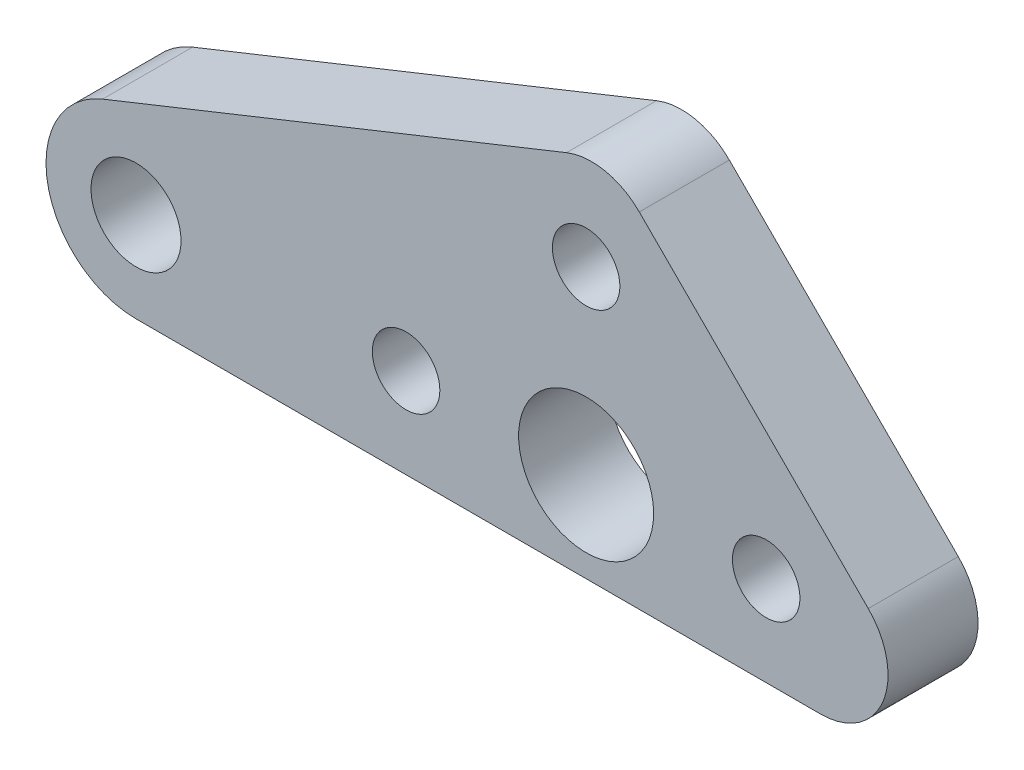
ISO-10303-21;
HEADER;
FILE_DESCRIPTION(('STEP AP214'),'2;1');
FILE_NAME('part.step','',(''),(''),'','','');
FILE_SCHEMA(('AUTOMOTIVE_DESIGN { 1 0 10303 214 1 1 1 1 }'));
ENDSEC;
DATA;
#1=APPLICATION_CONTEXT('core data for automotive mechanical design processes');
#2=APPLICATION_PROTOCOL_DEFINITION('international standard','automotive_design',2000,#1);
#3=PRODUCT_CONTEXT('',#1,'mechanical');
#4=PRODUCT('Part','Part','',(#3));
#5=PRODUCT_RELATED_PRODUCT_CATEGORY('part','',(#4));
#6=PRODUCT_DEFINITION_FORMATION('','',#4);
#7=PRODUCT_DEFINITION_CONTEXT('part definition',#1,'design');
#8=PRODUCT_DEFINITION('design','',#6,#7);
#9=PRODUCT_DEFINITION_SHAPE('','',#8);
#10=(LENGTH_UNIT() NAMED_UNIT(*) SI_UNIT(.MILLI.,.METRE.));
#11=(NAMED_UNIT(*) PLANE_ANGLE_UNIT() SI_UNIT($,.RADIAN.));
#12=(NAMED_UNIT(*) SI_UNIT($,.STERADIAN.) SOLID_ANGLE_UNIT());
#13=UNCERTAINTY_MEASURE_WITH_UNIT(LENGTH_MEASURE(1.E-05),#10,'distance_accuracy_value','');
#14=(GEOMETRIC_REPRESENTATION_CONTEXT(3) GLOBAL_UNCERTAINTY_ASSIGNED_CONTEXT((#13)) GLOBAL_UNIT_ASSIGNED_CONTEXT((#10,
#11,#12)) REPRESENTATION_CONTEXT('',''));
#15=CARTESIAN_POINT('',(0.,0.,0.));
#16=DIRECTION('',(0.,0.,1.));
#17=DIRECTION('',(1.,0.,0.));
#18=AXIS2_PLACEMENT_3D('',#15,#16,#17);
#19=CARTESIAN_POINT('',(10.4142135623731,-1.,4.));
#20=DIRECTION('',(0.,0.,1.));
#21=DIRECTION('',(1.,0.,0.));
#22=AXIS2_PLACEMENT_3D('',#19,#20,#21);
#23=PLANE('',#22);
#24=CARTESIAN_POINT('',(0.,0.,4.));
#25=DIRECTION('',(0.,0.,1.));
#26=DIRECTION('',(1.,0.,0.));
#27=AXIS2_PLACEMENT_3D('',#24,#25,#26);
#28=CIRCLE('',#27,3.);
#29=CARTESIAN_POINT('',(3.,0.,4.));
#30=VERTEX_POINT('',#29);
#31=EDGE_CURVE('E208',#30,#30,#28,.T.);
#32=ORIENTED_EDGE('',*,*,#31,.F.);
#33=EDGE_LOOP('',(#32));
#34=FACE_BOUND('',#33,.T.);
#35=CARTESIAN_POINT('',(8.,0.,4.));
#36=DIRECTION('',(0.,0.,1.));
#37=DIRECTION('',(1.,0.,0.));
#38=AXIS2_PLACEMENT_3D('',#35,#36,#37);
#39=CIRCLE('',#38,1.5);
#40=CARTESIAN_POINT('',(9.5,0.,4.));
#41=VERTEX_POINT('',#40);
#42=EDGE_CURVE('E147',#41,#41,#39,.T.);
#43=ORIENTED_EDGE('',*,*,#42,.F.);
#44=EDGE_LOOP('',(#43));
#45=FACE_BOUND('',#44,.T.);
#46=CARTESIAN_POINT('',(10.4142135623731,-1.,4.));
#47=DIRECTION('',(0.,0.,1.));
#48=DIRECTION('',(1.,0.,0.));
#49=AXIS2_PLACEMENT_3D('',#46,#47,#48);
#50=CIRCLE('',#49,3.);
#51=CARTESIAN_POINT('',(10.4142135623731,-4.,4.));
#52=VERTEX_POINT('',#51);
#53=CARTESIAN_POINT('',(12.5355339059327,1.12132034355964,4.));
#54=VERTEX_POINT('',#53);
#55=EDGE_CURVE('E148',#52,#54,#50,.T.);
#56=ORIENTED_EDGE('',*,*,#55,.T.);
#57=DIRECTION('',(-0.707106781186548,0.707106781186547,0.));
#58=VECTOR('',#57,1.);
#59=CARTESIAN_POINT('',(12.5355339059327,1.12132034355964,4.));
#60=LINE('',#59,#58);
#61=CARTESIAN_POINT('',(2.36216362994978,11.2946906195426,4.));
#62=VERTEX_POINT('',#61);
#63=EDGE_CURVE('E91',#54,#62,#60,.T.);
#64=ORIENTED_EDGE('',*,*,#63,.T.);
#65=CARTESIAN_POINT('',(0.240843286390138,9.17337027598296,4.));
#66=DIRECTION('',(0.,0.,1.));
#67=DIRECTION('',(-1.,0.,0.));
#68=AXIS2_PLACEMENT_3D('',#65,#66,#67);
#69=CIRCLE('',#68,3.);
#70=CARTESIAN_POINT('',(-0.873328742672173,11.9588003486387,4.));
#71=VERTEX_POINT('',#70);
#72=EDGE_CURVE('E104',#62,#71,#69,.T.);
#73=ORIENTED_EDGE('',*,*,#72,.T.);
#74=DIRECTION('',(-0.928476690885259,-0.371390676354104,0.));
#75=VECTOR('',#74,1.);
#76=CARTESIAN_POINT('',(-0.873328742672173,11.9588003486387,4.));
#77=LINE('',#76,#75);
#78=CARTESIAN_POINT('',(-21.4855627054164,3.71390676354104,4.));
#79=VERTEX_POINT('',#78);
#80=EDGE_CURVE('E98',#71,#79,#77,.T.);
#81=ORIENTED_EDGE('',*,*,#80,.T.);
#82=CARTESIAN_POINT('',(-20.,0.,4.));
#83=DIRECTION('',(0.,0.,1.));
#84=DIRECTION('',(1.,0.,0.));
#85=AXIS2_PLACEMENT_3D('',#82,#83,#84);
#86=CIRCLE('',#85,4.);
#87=CARTESIAN_POINT('',(-20.,-4.,4.));
#88=VERTEX_POINT('',#87);
#89=EDGE_CURVE('E102',#79,#88,#86,.T.);
#90=ORIENTED_EDGE('',*,*,#89,.T.);
#91=DIRECTION('',(1.,0.,0.));
#92=VECTOR('',#91,1.);
#93=CARTESIAN_POINT('',(-20.,-4.,4.));
#94=LINE('',#93,#92);
#95=EDGE_CURVE('E54',#88,#52,#94,.T.);
#96=ORIENTED_EDGE('',*,*,#95,.T.);
#97=EDGE_LOOP('',(#56,#64,#73,#81,#90,#96));
#98=FACE_BOUND('',#97,.T.);
#99=CARTESIAN_POINT('',(0.,8.,4.));
#100=DIRECTION('',(0.,0.,1.));
#101=DIRECTION('',(1.,0.,0.));
#102=AXIS2_PLACEMENT_3D('',#99,#100,#101);
#103=CIRCLE('',#102,1.5);
#104=CARTESIAN_POINT('',(1.5,8.,4.));
#105=VERTEX_POINT('',#104);
#106=EDGE_CURVE('E135',#105,#105,#103,.T.);
#107=ORIENTED_EDGE('',*,*,#106,.F.);
#108=EDGE_LOOP('',(#107));
#109=FACE_BOUND('',#108,.T.);
#110=CARTESIAN_POINT('',(-20.,0.,4.));
#111=DIRECTION('',(0.,0.,1.));
#112=DIRECTION('',(1.,0.,0.));
#113=AXIS2_PLACEMENT_3D('',#110,#111,#112);
#114=CIRCLE('',#113,2.);
#115=CARTESIAN_POINT('',(-18.,0.,4.));
#116=VERTEX_POINT('',#115);
#117=EDGE_CURVE('E213',#116,#116,#114,.T.);
#118=ORIENTED_EDGE('',*,*,#117,.F.);
#119=EDGE_LOOP('',(#118));
#120=FACE_BOUND('',#119,.T.);
#121=CARTESIAN_POINT('',(-8.,0.,4.));
#122=DIRECTION('',(0.,0.,1.));
#123=DIRECTION('',(1.,0.,0.));
#124=AXIS2_PLACEMENT_3D('',#121,#122,#123);
#125=CIRCLE('',#124,1.5);
#126=CARTESIAN_POINT('',(-6.5,0.,4.));
#127=VERTEX_POINT('',#126);
#128=EDGE_CURVE('E202',#127,#127,#125,.T.);
#129=ORIENTED_EDGE('',*,*,#128,.F.);
#130=EDGE_LOOP('',(#129));
#131=FACE_BOUND('',#130,.T.);
#132=ADVANCED_FACE('F37',(#34,#45,#98,#109,#120,#131),#23,.T.);
#133=CARTESIAN_POINT('',(10.4142135623731,-1.,0.));
#134=DIRECTION('',(0.,0.,1.));
#135=DIRECTION('',(1.,0.,0.));
#136=AXIS2_PLACEMENT_3D('',#133,#134,#135);
#137=PLANE('',#136);
#138=CARTESIAN_POINT('',(10.4142135623731,-1.,0.));
#139=DIRECTION('',(0.,0.,1.));
#140=DIRECTION('',(1.,0.,0.));
#141=AXIS2_PLACEMENT_3D('',#138,#139,#140);
#142=CIRCLE('',#141,3.);
#143=CARTESIAN_POINT('',(10.4142135623731,-4.,0.));
#144=VERTEX_POINT('',#143);
#145=CARTESIAN_POINT('',(12.5355339059327,1.12132034355964,0.));
#146=VERTEX_POINT('',#145);
#147=EDGE_CURVE('E141',#144,#146,#142,.T.);
#148=ORIENTED_EDGE('',*,*,#147,.F.);
#149=DIRECTION('',(1.,0.,0.));
#150=VECTOR('',#149,1.);
#151=CARTESIAN_POINT('',(-20.,-4.,0.));
#152=LINE('',#151,#150);
#153=CARTESIAN_POINT('',(-20.,-4.,0.));
#154=VERTEX_POINT('',#153);
#155=EDGE_CURVE('E83',#154,#144,#152,.T.);
#156=ORIENTED_EDGE('',*,*,#155,.F.);
#157=CARTESIAN_POINT('',(-20.,0.,0.));
#158=DIRECTION('',(0.,0.,1.));
#159=DIRECTION('',(1.,0.,0.));
#160=AXIS2_PLACEMENT_3D('',#157,#158,#159);
#161=CIRCLE('',#160,4.);
#162=CARTESIAN_POINT('',(-21.4855627054164,3.71390676354104,0.));
#163=VERTEX_POINT('',#162);
#164=EDGE_CURVE('E77',#163,#154,#161,.T.);
#165=ORIENTED_EDGE('',*,*,#164,.F.);
#166=DIRECTION('',(-0.928476690885259,-0.371390676354104,0.));
#167=VECTOR('',#166,1.);
#168=CARTESIAN_POINT('',(-0.873328742672173,11.9588003486387,0.));
#169=LINE('',#168,#167);
#170=CARTESIAN_POINT('',(-0.873328742672173,11.9588003486387,0.));
#171=VERTEX_POINT('',#170);
#172=EDGE_CURVE('E113',#171,#163,#169,.T.);
#173=ORIENTED_EDGE('',*,*,#172,.F.);
#174=CARTESIAN_POINT('',(0.240843286390138,9.17337027598296,0.));
#175=DIRECTION('',(0.,0.,1.));
#176=DIRECTION('',(-1.,0.,0.));
#177=AXIS2_PLACEMENT_3D('',#174,#175,#176);
#178=CIRCLE('',#177,3.);
#179=CARTESIAN_POINT('',(2.36216362994978,11.2946906195426,0.));
#180=VERTEX_POINT('',#179);
#181=EDGE_CURVE('E168',#180,#171,#178,.T.);
#182=ORIENTED_EDGE('',*,*,#181,.F.);
#183=DIRECTION('',(-0.707106781186548,0.707106781186547,0.));
#184=VECTOR('',#183,1.);
#185=CARTESIAN_POINT('',(12.5355339059327,1.12132034355964,0.));
#186=LINE('',#185,#184);
#187=EDGE_CURVE('E164',#146,#180,#186,.T.);
#188=ORIENTED_EDGE('',*,*,#187,.F.);
#189=EDGE_LOOP('',(#148,#156,#165,#173,#182,#188));
#190=FACE_BOUND('',#189,.T.);
#191=CARTESIAN_POINT('',(0.,8.,0.));
#192=DIRECTION('',(0.,0.,1.));
#193=DIRECTION('',(1.,0.,0.));
#194=AXIS2_PLACEMENT_3D('',#191,#192,#193);
#195=CIRCLE('',#194,1.5);
#196=CARTESIAN_POINT('',(1.5,8.,0.));
#197=VERTEX_POINT('',#196);
#198=EDGE_CURVE('E142',#197,#197,#195,.T.);
#199=ORIENTED_EDGE('',*,*,#198,.T.);
#200=EDGE_LOOP('',(#199));
#201=FACE_BOUND('',#200,.T.);
#202=CARTESIAN_POINT('',(8.,0.,0.));
#203=DIRECTION('',(0.,0.,1.));
#204=DIRECTION('',(1.,0.,0.));
#205=AXIS2_PLACEMENT_3D('',#202,#203,#204);
#206=CIRCLE('',#205,1.5);
#207=CARTESIAN_POINT('',(9.5,0.,0.));
#208=VERTEX_POINT('',#207);
#209=EDGE_CURVE('E143',#208,#208,#206,.T.);
#210=ORIENTED_EDGE('',*,*,#209,.T.);
#211=EDGE_LOOP('',(#210));
#212=FACE_BOUND('',#211,.T.);
#213=CARTESIAN_POINT('',(-20.,0.,0.));
#214=DIRECTION('',(0.,0.,1.));
#215=DIRECTION('',(1.,0.,0.));
#216=AXIS2_PLACEMENT_3D('',#213,#214,#215);
#217=CIRCLE('',#216,2.);
#218=CARTESIAN_POINT('',(-18.,0.,0.));
#219=VERTEX_POINT('',#218);
#220=EDGE_CURVE('E193',#219,#219,#217,.T.);
#221=ORIENTED_EDGE('',*,*,#220,.T.);
#222=EDGE_LOOP('',(#221));
#223=FACE_BOUND('',#222,.T.);
#224=CARTESIAN_POINT('',(0.,0.,0.));
#225=DIRECTION('',(0.,0.,1.));
#226=DIRECTION('',(1.,0.,0.));
#227=AXIS2_PLACEMENT_3D('',#224,#225,#226);
#228=CIRCLE('',#227,3.);
#229=CARTESIAN_POINT('',(3.,0.,0.));
#230=VERTEX_POINT('',#229);
#231=EDGE_CURVE('E197',#230,#230,#228,.T.);
#232=ORIENTED_EDGE('',*,*,#231,.T.);
#233=EDGE_LOOP('',(#232));
#234=FACE_BOUND('',#233,.T.);
#235=CARTESIAN_POINT('',(-8.,0.,0.));
#236=DIRECTION('',(0.,0.,1.));
#237=DIRECTION('',(1.,0.,0.));
#238=AXIS2_PLACEMENT_3D('',#235,#236,#237);
#239=CIRCLE('',#238,1.5);
#240=CARTESIAN_POINT('',(-6.5,0.,0.));
#241=VERTEX_POINT('',#240);
#242=EDGE_CURVE('E200',#241,#241,#239,.T.);
#243=ORIENTED_EDGE('',*,*,#242,.T.);
#244=EDGE_LOOP('',(#243));
#245=FACE_BOUND('',#244,.T.);
#246=ADVANCED_FACE('F181',(#190,#201,#212,#223,#234,#245),#137,.F.);
#247=CARTESIAN_POINT('',(10.4142135623731,-1.,4.));
#248=DIRECTION('',(0.,0.,-1.));
#249=DIRECTION('',(-1.,0.,0.));
#250=AXIS2_PLACEMENT_3D('',#247,#248,#249);
#251=CYLINDRICAL_SURFACE('',#250,3.);
#252=ORIENTED_EDGE('',*,*,#147,.T.);
#253=DIRECTION('',(0.,0.,-1.));
#254=VECTOR('',#253,1.);
#255=CARTESIAN_POINT('',(12.5355339059327,1.12132034355964,4.));
#256=LINE('',#255,#254);
#257=EDGE_CURVE('E12',#54,#146,#256,.T.);
#258=ORIENTED_EDGE('',*,*,#257,.F.);
#259=ORIENTED_EDGE('',*,*,#55,.F.);
#260=DIRECTION('',(0.,0.,-1.));
#261=VECTOR('',#260,1.);
#262=CARTESIAN_POINT('',(10.4142135623731,-4.,4.));
#263=LINE('',#262,#261);
#264=EDGE_CURVE('E121',#52,#144,#263,.T.);
#265=ORIENTED_EDGE('',*,*,#264,.T.);
#266=EDGE_LOOP('',(#252,#258,#259,#265));
#267=FACE_BOUND('',#266,.T.);
#268=ADVANCED_FACE('F39',(#267),#251,.T.);
#269=CARTESIAN_POINT('',(12.5355339059327,1.12132034355964,4.));
#270=DIRECTION('',(-0.707106781186547,-0.707106781186548,0.));
#271=DIRECTION('',(0.707106781186548,-0.707106781186547,0.));
#272=AXIS2_PLACEMENT_3D('',#269,#270,#271);
#273=PLANE('',#272);
#274=ORIENTED_EDGE('',*,*,#187,.T.);
#275=DIRECTION('',(0.,0.,-1.));
#276=VECTOR('',#275,1.);
#277=CARTESIAN_POINT('',(2.36216362994978,11.2946906195426,4.));
#278=LINE('',#277,#276);
#279=EDGE_CURVE('E46',#62,#180,#278,.T.);
#280=ORIENTED_EDGE('',*,*,#279,.F.);
#281=ORIENTED_EDGE('',*,*,#63,.F.);
#282=ORIENTED_EDGE('',*,*,#257,.T.);
#283=EDGE_LOOP('',(#274,#280,#281,#282));
#284=FACE_BOUND('',#283,.T.);
#285=ADVANCED_FACE('F163',(#284),#273,.F.);
#286=CARTESIAN_POINT('',(0.240843286390138,9.17337027598296,4.));
#287=DIRECTION('',(0.,0.,-1.));
#288=DIRECTION('',(-1.,0.,0.));
#289=AXIS2_PLACEMENT_3D('',#286,#287,#288);
#290=CYLINDRICAL_SURFACE('',#289,3.);
#291=ORIENTED_EDGE('',*,*,#181,.T.);
#292=DIRECTION('',(0.,0.,-1.));
#293=VECTOR('',#292,1.);
#294=CARTESIAN_POINT('',(-0.873328742672173,11.9588003486387,4.));
#295=LINE('',#294,#293);
#296=EDGE_CURVE('E114',#71,#171,#295,.T.);
#297=ORIENTED_EDGE('',*,*,#296,.F.);
#298=ORIENTED_EDGE('',*,*,#72,.F.);
#299=ORIENTED_EDGE('',*,*,#279,.T.);
#300=EDGE_LOOP('',(#291,#297,#298,#299));
#301=FACE_BOUND('',#300,.T.);
#302=ADVANCED_FACE('F167',(#301),#290,.T.);
#303=CARTESIAN_POINT('',(-0.873328742672173,11.9588003486387,4.));
#304=DIRECTION('',(0.371390676354104,-0.928476690885259,0.));
#305=DIRECTION('',(0.92847669088526,0.371390676354104,0.));
#306=AXIS2_PLACEMENT_3D('',#303,#304,#305);
#307=PLANE('',#306);
#308=ORIENTED_EDGE('',*,*,#172,.T.);
#309=DIRECTION('',(0.,0.,-1.));
#310=VECTOR('',#309,1.);
#311=CARTESIAN_POINT('',(-21.4855627054164,3.71390676354104,4.));
#312=LINE('',#311,#310);
#313=EDGE_CURVE('E110',#79,#163,#312,.T.);
#314=ORIENTED_EDGE('',*,*,#313,.F.);
#315=ORIENTED_EDGE('',*,*,#80,.F.);
#316=ORIENTED_EDGE('',*,*,#296,.T.);
#317=EDGE_LOOP('',(#308,#314,#315,#316));
#318=FACE_BOUND('',#317,.T.);
#319=ADVANCED_FACE('F111',(#318),#307,.F.);
#320=CARTESIAN_POINT('',(-20.,0.,4.));
#321=DIRECTION('',(0.,0.,-1.));
#322=DIRECTION('',(-1.,0.,0.));
#323=AXIS2_PLACEMENT_3D('',#320,#321,#322);
#324=CYLINDRICAL_SURFACE('',#323,4.);
#325=ORIENTED_EDGE('',*,*,#164,.T.);
#326=DIRECTION('',(0.,0.,-1.));
#327=VECTOR('',#326,1.);
#328=CARTESIAN_POINT('',(-20.,-4.,4.));
#329=LINE('',#328,#327);
#330=EDGE_CURVE('E115',#88,#154,#329,.T.);
#331=ORIENTED_EDGE('',*,*,#330,.F.);
#332=ORIENTED_EDGE('',*,*,#89,.F.);
#333=ORIENTED_EDGE('',*,*,#313,.T.);
#334=EDGE_LOOP('',(#325,#331,#332,#333));
#335=FACE_BOUND('',#334,.T.);
#336=ADVANCED_FACE('F117',(#335),#324,.T.);
#337=CARTESIAN_POINT('',(-20.,-4.,4.));
#338=DIRECTION('',(0.,1.,0.));
#339=DIRECTION('',(-1.,0.,0.));
#340=AXIS2_PLACEMENT_3D('',#337,#338,#339);
#341=PLANE('',#340);
#342=ORIENTED_EDGE('',*,*,#155,.T.);
#343=ORIENTED_EDGE('',*,*,#264,.F.);
#344=ORIENTED_EDGE('',*,*,#95,.F.);
#345=ORIENTED_EDGE('',*,*,#330,.T.);
#346=EDGE_LOOP('',(#342,#343,#344,#345));
#347=FACE_BOUND('',#346,.T.);
#348=ADVANCED_FACE('F236',(#347),#341,.F.);
#349=CARTESIAN_POINT('',(0.,8.,4.));
#350=DIRECTION('',(0.,0.,-1.));
#351=DIRECTION('',(-1.,0.,0.));
#352=AXIS2_PLACEMENT_3D('',#349,#350,#351);
#353=CYLINDRICAL_SURFACE('',#352,1.5);
#354=ORIENTED_EDGE('',*,*,#106,.T.);
#355=EDGE_LOOP('',(#354));
#356=FACE_BOUND('',#355,.T.);
#357=ORIENTED_EDGE('',*,*,#198,.F.);
#358=EDGE_LOOP('',(#357));
#359=FACE_BOUND('',#358,.T.);
#360=ADVANCED_FACE('F233',(#356,#359),#353,.F.);
#361=CARTESIAN_POINT('',(8.,0.,4.));
#362=DIRECTION('',(0.,0.,-1.));
#363=DIRECTION('',(-1.,0.,0.));
#364=AXIS2_PLACEMENT_3D('',#361,#362,#363);
#365=CYLINDRICAL_SURFACE('',#364,1.5);
#366=ORIENTED_EDGE('',*,*,#42,.T.);
#367=EDGE_LOOP('',(#366));
#368=FACE_BOUND('',#367,.T.);
#369=ORIENTED_EDGE('',*,*,#209,.F.);
#370=EDGE_LOOP('',(#369));
#371=FACE_BOUND('',#370,.T.);
#372=ADVANCED_FACE('F223',(#368,#371),#365,.F.);
#373=CARTESIAN_POINT('',(-20.,0.,4.));
#374=DIRECTION('',(0.,0.,-1.));
#375=DIRECTION('',(-1.,0.,0.));
#376=AXIS2_PLACEMENT_3D('',#373,#374,#375);
#377=CYLINDRICAL_SURFACE('',#376,2.);
#378=ORIENTED_EDGE('',*,*,#117,.T.);
#379=EDGE_LOOP('',(#378));
#380=FACE_BOUND('',#379,.T.);
#381=ORIENTED_EDGE('',*,*,#220,.F.);
#382=EDGE_LOOP('',(#381));
#383=FACE_BOUND('',#382,.T.);
#384=ADVANCED_FACE('F301',(#380,#383),#377,.F.);
#385=CARTESIAN_POINT('',(0.,0.,4.));
#386=DIRECTION('',(0.,0.,-1.));
#387=DIRECTION('',(-1.,0.,0.));
#388=AXIS2_PLACEMENT_3D('',#385,#386,#387);
#389=CYLINDRICAL_SURFACE('',#388,3.);
#390=ORIENTED_EDGE('',*,*,#31,.T.);
#391=EDGE_LOOP('',(#390));
#392=FACE_BOUND('',#391,.T.);
#393=ORIENTED_EDGE('',*,*,#231,.F.);
#394=EDGE_LOOP('',(#393));
#395=FACE_BOUND('',#394,.T.);
#396=ADVANCED_FACE('F308',(#392,#395),#389,.F.);
#397=CARTESIAN_POINT('',(-8.,0.,4.));
#398=DIRECTION('',(0.,0.,-1.));
#399=DIRECTION('',(-1.,0.,0.));
#400=AXIS2_PLACEMENT_3D('',#397,#398,#399);
#401=CYLINDRICAL_SURFACE('',#400,1.5);
#402=ORIENTED_EDGE('',*,*,#128,.T.);
#403=EDGE_LOOP('',(#402));
#404=FACE_BOUND('',#403,.T.);
#405=ORIENTED_EDGE('',*,*,#242,.F.);
#406=EDGE_LOOP('',(#405));
#407=FACE_BOUND('',#406,.T.);
#408=ADVANCED_FACE('F317',(#404,#407),#401,.F.);
#409=CLOSED_SHELL('',(#132,#246,#268,#285,#302,#319,#336,#348,#360,#372,#384,#396,#408));
#410=MANIFOLD_SOLID_BREP('B2',#409);
#411=ADVANCED_BREP_SHAPE_REPRESENTATION('',(#18,#410),#14);
#412=SHAPE_DEFINITION_REPRESENTATION(#9,#411);
ENDSEC;
END-ISO-10303-21;
